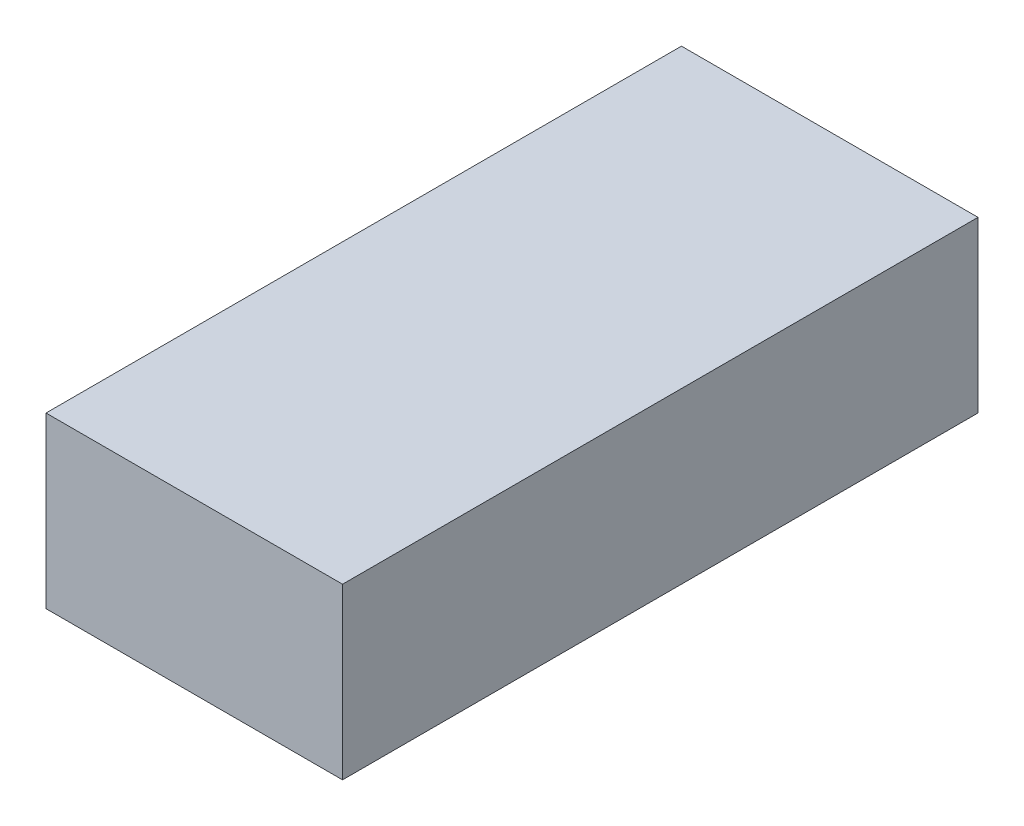
ISO-10303-21;
HEADER;
FILE_DESCRIPTION(('STEP AP214'),'2;1');
FILE_NAME('part.step','',(''),(''),'','','');
FILE_SCHEMA(('AUTOMOTIVE_DESIGN { 1 0 10303 214 1 1 1 1 }'));
ENDSEC;
DATA;
#1=APPLICATION_CONTEXT('core data for automotive mechanical design processes');
#2=APPLICATION_PROTOCOL_DEFINITION('international standard','automotive_design',2000,#1);
#3=PRODUCT_CONTEXT('',#1,'mechanical');
#4=PRODUCT('Part','Part','',(#3));
#5=PRODUCT_RELATED_PRODUCT_CATEGORY('part','',(#4));
#6=PRODUCT_DEFINITION_FORMATION('','',#4);
#7=PRODUCT_DEFINITION_CONTEXT('part definition',#1,'design');
#8=PRODUCT_DEFINITION('design','',#6,#7);
#9=PRODUCT_DEFINITION_SHAPE('','',#8);
#10=(LENGTH_UNIT() NAMED_UNIT(*) SI_UNIT(.MILLI.,.METRE.));
#11=(NAMED_UNIT(*) PLANE_ANGLE_UNIT() SI_UNIT($,.RADIAN.));
#12=(NAMED_UNIT(*) SI_UNIT($,.STERADIAN.) SOLID_ANGLE_UNIT());
#13=UNCERTAINTY_MEASURE_WITH_UNIT(LENGTH_MEASURE(1.E-05),#10,'distance_accuracy_value','');
#14=(GEOMETRIC_REPRESENTATION_CONTEXT(3) GLOBAL_UNCERTAINTY_ASSIGNED_CONTEXT((#13)) GLOBAL_UNIT_ASSIGNED_CONTEXT((#10,
#11,#12)) REPRESENTATION_CONTEXT('',''));
#15=CARTESIAN_POINT('',(0.,0.,0.));
#16=DIRECTION('',(0.,0.,1.));
#17=DIRECTION('',(1.,0.,0.));
#18=AXIS2_PLACEMENT_3D('',#15,#16,#17);
#19=CARTESIAN_POINT('',(24.8,1.52,14.26));
#20=DIRECTION('',(0.,1.,0.));
#21=DIRECTION('',(0.,0.,1.));
#22=AXIS2_PLACEMENT_3D('',#19,#20,#21);
#23=PLANE('',#22);
#24=DIRECTION('',(0.,0.,1.));
#25=VECTOR('',#24,1.);
#26=CARTESIAN_POINT('',(24.1,1.52,12.76));
#27=LINE('',#26,#25);
#28=CARTESIAN_POINT('',(24.1,1.52,12.76));
#29=VERTEX_POINT('',#28);
#30=CARTESIAN_POINT('',(24.1,1.52,15.76));
#31=VERTEX_POINT('',#30);
#32=EDGE_CURVE('E79',#29,#31,#27,.T.);
#33=ORIENTED_EDGE('',*,*,#32,.F.);
#34=DIRECTION('',(-1.,0.,0.));
#35=VECTOR('',#34,1.);
#36=CARTESIAN_POINT('',(25.5,1.52,12.76));
#37=LINE('',#36,#35);
#38=CARTESIAN_POINT('',(25.5,1.52,12.76));
#39=VERTEX_POINT('',#38);
#40=EDGE_CURVE('E55',#39,#29,#37,.T.);
#41=ORIENTED_EDGE('',*,*,#40,.F.);
#42=DIRECTION('',(0.,0.,-1.));
#43=VECTOR('',#42,1.);
#44=CARTESIAN_POINT('',(25.5,1.52,15.76));
#45=LINE('',#44,#43);
#46=CARTESIAN_POINT('',(25.5,1.52,15.76));
#47=VERTEX_POINT('',#46);
#48=EDGE_CURVE('E57',#47,#39,#45,.T.);
#49=ORIENTED_EDGE('',*,*,#48,.F.);
#50=DIRECTION('',(1.,0.,0.));
#51=VECTOR('',#50,1.);
#52=CARTESIAN_POINT('',(24.1,1.52,15.76));
#53=LINE('',#52,#51);
#54=EDGE_CURVE('E20',#31,#47,#53,.T.);
#55=ORIENTED_EDGE('',*,*,#54,.F.);
#56=EDGE_LOOP('',(#33,#41,#49,#55));
#57=FACE_BOUND('',#56,.T.);
#58=ADVANCED_FACE('F17',(#57),#23,.F.);
#59=CARTESIAN_POINT('',(24.1,1.52,15.76));
#60=DIRECTION('',(0.,0.,1.));
#61=DIRECTION('',(1.,0.,0.));
#62=AXIS2_PLACEMENT_3D('',#59,#60,#61);
#63=PLANE('',#62);
#64=DIRECTION('',(1.,0.,0.));
#65=VECTOR('',#64,1.);
#66=CARTESIAN_POINT('',(24.8,2.32,15.76));
#67=LINE('',#66,#65);
#68=CARTESIAN_POINT('',(24.1,2.32,15.76));
#69=VERTEX_POINT('',#68);
#70=CARTESIAN_POINT('',(25.5,2.32,15.76));
#71=VERTEX_POINT('',#70);
#72=EDGE_CURVE('E83',#69,#71,#67,.T.);
#73=ORIENTED_EDGE('',*,*,#72,.F.);
#74=DIRECTION('',(0.,1.,0.));
#75=VECTOR('',#74,1.);
#76=CARTESIAN_POINT('',(24.1,1.52,15.76));
#77=LINE('',#76,#75);
#78=EDGE_CURVE('E68',#31,#69,#77,.T.);
#79=ORIENTED_EDGE('',*,*,#78,.F.);
#80=ORIENTED_EDGE('',*,*,#54,.T.);
#81=DIRECTION('',(0.,1.,0.));
#82=VECTOR('',#81,1.);
#83=CARTESIAN_POINT('',(25.5,1.52,15.76));
#84=LINE('',#83,#82);
#85=EDGE_CURVE('E63',#71,#47,#84,.F.);
#86=ORIENTED_EDGE('',*,*,#85,.F.);
#87=EDGE_LOOP('',(#73,#79,#80,#86));
#88=FACE_BOUND('',#87,.T.);
#89=ADVANCED_FACE('F65',(#88),#63,.T.);
#90=CARTESIAN_POINT('',(25.5,1.52,15.76));
#91=DIRECTION('',(1.,0.,0.));
#92=DIRECTION('',(0.,0.,-1.));
#93=AXIS2_PLACEMENT_3D('',#90,#91,#92);
#94=PLANE('',#93);
#95=DIRECTION('',(0.,0.,1.));
#96=VECTOR('',#95,1.);
#97=CARTESIAN_POINT('',(25.5,2.32,14.26));
#98=LINE('',#97,#96);
#99=CARTESIAN_POINT('',(25.5,2.32,12.76));
#100=VERTEX_POINT('',#99);
#101=EDGE_CURVE('E72',#71,#100,#98,.F.);
#102=ORIENTED_EDGE('',*,*,#101,.F.);
#103=ORIENTED_EDGE('',*,*,#85,.T.);
#104=ORIENTED_EDGE('',*,*,#48,.T.);
#105=DIRECTION('',(0.,1.,0.));
#106=VECTOR('',#105,1.);
#107=CARTESIAN_POINT('',(25.5,1.52,12.76));
#108=LINE('',#107,#106);
#109=EDGE_CURVE('E75',#100,#39,#108,.F.);
#110=ORIENTED_EDGE('',*,*,#109,.F.);
#111=EDGE_LOOP('',(#102,#103,#104,#110));
#112=FACE_BOUND('',#111,.T.);
#113=ADVANCED_FACE('F70',(#112),#94,.T.);
#114=CARTESIAN_POINT('',(25.5,1.52,12.76));
#115=DIRECTION('',(0.,0.,-1.));
#116=DIRECTION('',(-1.,0.,0.));
#117=AXIS2_PLACEMENT_3D('',#114,#115,#116);
#118=PLANE('',#117);
#119=DIRECTION('',(1.,0.,0.));
#120=VECTOR('',#119,1.);
#121=CARTESIAN_POINT('',(24.8,2.32,12.76));
#122=LINE('',#121,#120);
#123=CARTESIAN_POINT('',(24.1,2.32,12.76));
#124=VERTEX_POINT('',#123);
#125=EDGE_CURVE('E26',#100,#124,#122,.F.);
#126=ORIENTED_EDGE('',*,*,#125,.F.);
#127=ORIENTED_EDGE('',*,*,#109,.T.);
#128=ORIENTED_EDGE('',*,*,#40,.T.);
#129=DIRECTION('',(0.,1.,0.));
#130=VECTOR('',#129,1.);
#131=CARTESIAN_POINT('',(24.1,1.52,12.76));
#132=LINE('',#131,#130);
#133=EDGE_CURVE('E35',#124,#29,#132,.F.);
#134=ORIENTED_EDGE('',*,*,#133,.F.);
#135=EDGE_LOOP('',(#126,#127,#128,#134));
#136=FACE_BOUND('',#135,.T.);
#137=ADVANCED_FACE('F89',(#136),#118,.T.);
#138=CARTESIAN_POINT('',(24.1,1.52,12.76));
#139=DIRECTION('',(-1.,0.,0.));
#140=DIRECTION('',(0.,0.,1.));
#141=AXIS2_PLACEMENT_3D('',#138,#139,#140);
#142=PLANE('',#141);
#143=DIRECTION('',(0.,0.,1.));
#144=VECTOR('',#143,1.);
#145=CARTESIAN_POINT('',(24.1,2.32,14.26));
#146=LINE('',#145,#144);
#147=EDGE_CURVE('E11',#124,#69,#146,.T.);
#148=ORIENTED_EDGE('',*,*,#147,.F.);
#149=ORIENTED_EDGE('',*,*,#133,.T.);
#150=ORIENTED_EDGE('',*,*,#32,.T.);
#151=ORIENTED_EDGE('',*,*,#78,.T.);
#152=EDGE_LOOP('',(#148,#149,#150,#151));
#153=FACE_BOUND('',#152,.T.);
#154=ADVANCED_FACE('F91',(#153),#142,.T.);
#155=CARTESIAN_POINT('',(24.8,2.32,14.26));
#156=DIRECTION('',(0.,1.,0.));
#157=DIRECTION('',(0.,0.,1.));
#158=AXIS2_PLACEMENT_3D('',#155,#156,#157);
#159=PLANE('',#158);
#160=ORIENTED_EDGE('',*,*,#125,.T.);
#161=ORIENTED_EDGE('',*,*,#147,.T.);
#162=ORIENTED_EDGE('',*,*,#72,.T.);
#163=ORIENTED_EDGE('',*,*,#101,.T.);
#164=EDGE_LOOP('',(#160,#161,#162,#163));
#165=FACE_BOUND('',#164,.T.);
#166=ADVANCED_FACE('F88',(#165),#159,.T.);
#167=CLOSED_SHELL('',(#58,#89,#113,#137,#154,#166));
#168=MANIFOLD_SOLID_BREP('B1',#167);
#169=ADVANCED_BREP_SHAPE_REPRESENTATION('',(#18,#168),#14);
#170=SHAPE_DEFINITION_REPRESENTATION(#9,#169);
ENDSEC;
END-ISO-10303-21;
